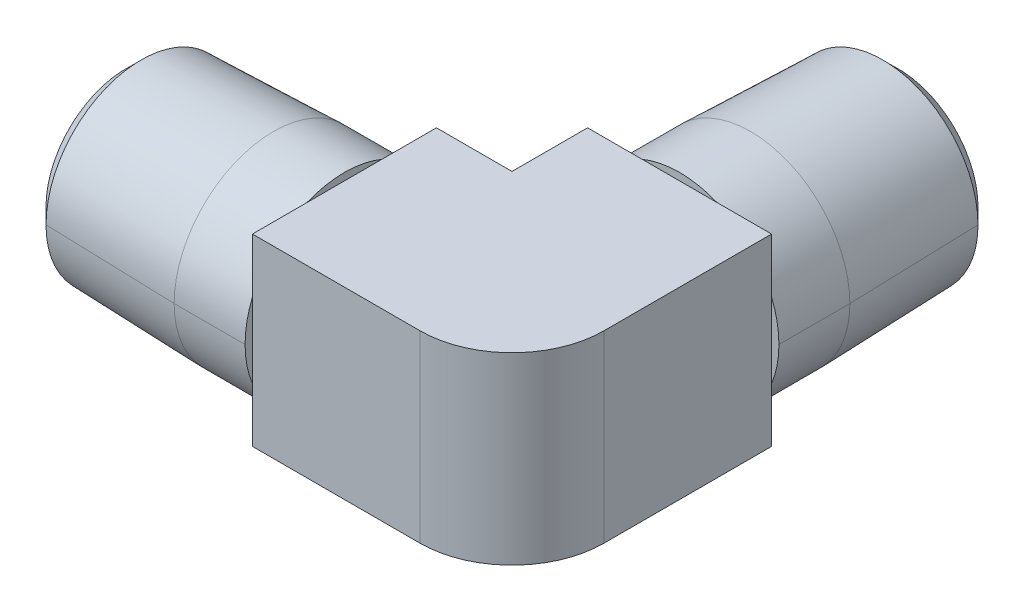
ISO-10303-21;
HEADER;
FILE_DESCRIPTION(('STEP AP214'),'2;1');
FILE_NAME('part.step','',(''),(''),'','','');
FILE_SCHEMA(('AUTOMOTIVE_DESIGN { 1 0 10303 214 1 1 1 1 }'));
ENDSEC;
DATA;
#1=APPLICATION_CONTEXT('core data for automotive mechanical design processes');
#2=APPLICATION_PROTOCOL_DEFINITION('international standard','automotive_design',2000,#1);
#3=PRODUCT_CONTEXT('',#1,'mechanical');
#4=PRODUCT('Part','Part','',(#3));
#5=PRODUCT_RELATED_PRODUCT_CATEGORY('part','',(#4));
#6=PRODUCT_DEFINITION_FORMATION('','',#4);
#7=PRODUCT_DEFINITION_CONTEXT('part definition',#1,'design');
#8=PRODUCT_DEFINITION('design','',#6,#7);
#9=PRODUCT_DEFINITION_SHAPE('','',#8);
#10=(LENGTH_UNIT() NAMED_UNIT(*) SI_UNIT(.MILLI.,.METRE.));
#11=(NAMED_UNIT(*) PLANE_ANGLE_UNIT() SI_UNIT($,.RADIAN.));
#12=(NAMED_UNIT(*) SI_UNIT($,.STERADIAN.) SOLID_ANGLE_UNIT());
#13=UNCERTAINTY_MEASURE_WITH_UNIT(LENGTH_MEASURE(1.E-05),#10,'distance_accuracy_value','');
#14=(GEOMETRIC_REPRESENTATION_CONTEXT(3) GLOBAL_UNCERTAINTY_ASSIGNED_CONTEXT((#13)) GLOBAL_UNIT_ASSIGNED_CONTEXT((#10,
#11,#12)) REPRESENTATION_CONTEXT('',''));
#15=CARTESIAN_POINT('',(0.,0.,0.));
#16=DIRECTION('',(0.,0.,1.));
#17=DIRECTION('',(1.,0.,0.));
#18=AXIS2_PLACEMENT_3D('',#15,#16,#17);
#19=CARTESIAN_POINT('',(26.67,0.,-21.56714));
#20=DIRECTION('',(0.,0.,1.));
#21=DIRECTION('',(-1.,0.,0.));
#22=AXIS2_PLACEMENT_3D('',#19,#20,#21);
#23=CONICAL_SURFACE('',#22,6.69912197832236,0.0311250383214148);
#24=DIRECTION('',(-0.0311200130745937,0.,0.999515655098127));
#25=VECTOR('',#24,1.);
#26=CARTESIAN_POINT('',(19.9708780216776,0.,-21.56714));
#27=LINE('',#26,#25);
#28=CARTESIAN_POINT('',(20.0962574044187,0.,-25.5940874044187));
#29=VERTEX_POINT('',#28);
#30=CARTESIAN_POINT('',(19.812,0.,-16.46428));
#31=VERTEX_POINT('',#30);
#32=EDGE_CURVE('E27',#29,#31,#27,.T.);
#33=ORIENTED_EDGE('',*,*,#32,.F.);
#34=CARTESIAN_POINT('',(26.67,0.,-25.5940874044187));
#35=DIRECTION('',(0.,0.,1.));
#36=DIRECTION('',(-1.,0.,0.));
#37=AXIS2_PLACEMENT_3D('',#34,#35,#36);
#38=CIRCLE('',#37,6.57374259558132);
#39=CARTESIAN_POINT('',(33.2437425955813,0.,-25.5940874044187));
#40=VERTEX_POINT('',#39);
#41=EDGE_CURVE('E323',#29,#40,#38,.T.);
#42=ORIENTED_EDGE('',*,*,#41,.T.);
#43=DIRECTION('',(-0.0311200130745934,0.,-0.999515655098127));
#44=VECTOR('',#43,1.);
#45=CARTESIAN_POINT('',(33.3691219783224,0.,-21.56714));
#46=LINE('',#45,#44);
#47=CARTESIAN_POINT('',(33.528,0.,-16.46428));
#48=VERTEX_POINT('',#47);
#49=EDGE_CURVE('E10',#48,#40,#46,.T.);
#50=ORIENTED_EDGE('',*,*,#49,.F.);
#51=CARTESIAN_POINT('',(26.67,0.,-16.46428));
#52=DIRECTION('',(0.,0.,1.));
#53=DIRECTION('',(-1.,0.,0.));
#54=AXIS2_PLACEMENT_3D('',#51,#52,#53);
#55=CIRCLE('',#54,6.858);
#56=EDGE_CURVE('E320',#31,#48,#55,.T.);
#57=ORIENTED_EDGE('',*,*,#56,.F.);
#58=EDGE_LOOP('',(#33,#42,#50,#57));
#59=FACE_BOUND('',#58,.T.);
#60=ADVANCED_FACE('F16',(#59),#23,.T.);
#61=CARTESIAN_POINT('',(26.67,0.,-21.56714));
#62=DIRECTION('',(0.,0.,1.));
#63=DIRECTION('',(-1.,0.,0.));
#64=AXIS2_PLACEMENT_3D('',#61,#62,#63);
#65=CONICAL_SURFACE('',#64,6.69912197832236,0.0311250383214148);
#66=ORIENTED_EDGE('',*,*,#32,.T.);
#67=CARTESIAN_POINT('',(26.67,0.,-16.46428));
#68=DIRECTION('',(0.,0.,1.));
#69=DIRECTION('',(-1.,0.,0.));
#70=AXIS2_PLACEMENT_3D('',#67,#68,#69);
#71=CIRCLE('',#70,6.858);
#72=EDGE_CURVE('E324',#48,#31,#71,.T.);
#73=ORIENTED_EDGE('',*,*,#72,.F.);
#74=ORIENTED_EDGE('',*,*,#49,.T.);
#75=CARTESIAN_POINT('',(26.67,0.,-25.5940874044187));
#76=DIRECTION('',(0.,0.,1.));
#77=DIRECTION('',(-1.,0.,0.));
#78=AXIS2_PLACEMENT_3D('',#75,#76,#77);
#79=CIRCLE('',#78,6.57374259558132);
#80=EDGE_CURVE('E399',#40,#29,#79,.T.);
#81=ORIENTED_EDGE('',*,*,#80,.T.);
#82=EDGE_LOOP('',(#66,#73,#74,#81));
#83=FACE_BOUND('',#82,.T.);
#84=ADVANCED_FACE('F924',(#83),#65,.T.);
#85=CARTESIAN_POINT('',(26.67,0.,-25.989915));
#86=DIRECTION('',(0.,0.,1.));
#87=DIRECTION('',(-1.,0.,0.));
#88=AXIS2_PLACEMENT_3D('',#85,#86,#87);
#89=CONICAL_SURFACE('',#88,6.177915,0.785398163397449);
#90=DIRECTION('',(0.707106781186548,0.,-0.707106781186547));
#91=VECTOR('',#90,1.);
#92=CARTESIAN_POINT('',(20.492085,0.,-25.989915));
#93=LINE('',#92,#91);
#94=CARTESIAN_POINT('',(21.17217,0.,-26.67));
#95=VERTEX_POINT('',#94);
#96=EDGE_CURVE('E410',#29,#95,#93,.T.);
#97=ORIENTED_EDGE('',*,*,#96,.T.);
#98=CARTESIAN_POINT('',(26.67,0.,-26.67));
#99=DIRECTION('',(0.,0.,-1.));
#100=DIRECTION('',(-1.,0.,0.));
#101=AXIS2_PLACEMENT_3D('',#98,#99,#100);
#102=CIRCLE('',#101,5.49783);
#103=CARTESIAN_POINT('',(32.16783,0.,-26.67));
#104=VERTEX_POINT('',#103);
#105=EDGE_CURVE('E417',#104,#95,#102,.T.);
#106=ORIENTED_EDGE('',*,*,#105,.F.);
#107=DIRECTION('',(0.707106781186548,0.,0.707106781186547));
#108=VECTOR('',#107,1.);
#109=CARTESIAN_POINT('',(32.847915,0.,-25.989915));
#110=LINE('',#109,#108);
#111=EDGE_CURVE('E396',#104,#40,#110,.T.);
#112=ORIENTED_EDGE('',*,*,#111,.T.);
#113=ORIENTED_EDGE('',*,*,#41,.F.);
#114=EDGE_LOOP('',(#97,#106,#112,#113));
#115=FACE_BOUND('',#114,.T.);
#116=ADVANCED_FACE('F920',(#115),#89,.T.);
#117=CARTESIAN_POINT('',(26.67,0.,-14.01572));
#118=DIRECTION('',(0.,0.,1.));
#119=DIRECTION('',(-1.,0.,0.));
#120=AXIS2_PLACEMENT_3D('',#117,#118,#119);
#121=CYLINDRICAL_SURFACE('',#120,6.858);
#122=DIRECTION('',(0.,0.,1.));
#123=VECTOR('',#122,1.);
#124=CARTESIAN_POINT('',(19.812,0.,-14.01572));
#125=LINE('',#124,#123);
#126=CARTESIAN_POINT('',(19.812,0.,-11.56716));
#127=VERTEX_POINT('',#126);
#128=EDGE_CURVE('E20',#31,#127,#125,.T.);
#129=ORIENTED_EDGE('',*,*,#128,.F.);
#130=ORIENTED_EDGE('',*,*,#56,.T.);
#131=DIRECTION('',(0.,0.,-1.));
#132=VECTOR('',#131,1.);
#133=CARTESIAN_POINT('',(33.528,0.,-14.01572));
#134=LINE('',#133,#132);
#135=CARTESIAN_POINT('',(33.528,0.,-11.56716));
#136=VERTEX_POINT('',#135);
#137=EDGE_CURVE('E408',#136,#48,#134,.T.);
#138=ORIENTED_EDGE('',*,*,#137,.F.);
#139=CARTESIAN_POINT('',(26.67,0.,-11.56716));
#140=DIRECTION('',(0.,0.,1.));
#141=DIRECTION('',(-1.,0.,0.));
#142=AXIS2_PLACEMENT_3D('',#139,#140,#141);
#143=CIRCLE('',#142,6.858);
#144=CARTESIAN_POINT('',(33.02,-2.59030191290514,-11.56716));
#145=VERTEX_POINT('',#144);
#146=EDGE_CURVE('E516',#145,#136,#143,.T.);
#147=ORIENTED_EDGE('',*,*,#146,.F.);
#148=CARTESIAN_POINT('',(26.67,0.,-11.56716));
#149=DIRECTION('',(0.,0.,1.));
#150=DIRECTION('',(-1.,0.,0.));
#151=AXIS2_PLACEMENT_3D('',#148,#149,#150);
#152=CIRCLE('',#151,6.858);
#153=CARTESIAN_POINT('',(29.2603019129051,-6.35,-11.56716));
#154=VERTEX_POINT('',#153);
#155=EDGE_CURVE('E430',#154,#145,#152,.T.);
#156=ORIENTED_EDGE('',*,*,#155,.F.);
#157=CARTESIAN_POINT('',(26.67,0.,-11.56716));
#158=DIRECTION('',(0.,0.,1.));
#159=DIRECTION('',(-1.,0.,0.));
#160=AXIS2_PLACEMENT_3D('',#157,#158,#159);
#161=CIRCLE('',#160,6.858);
#162=CARTESIAN_POINT('',(24.0796980870949,-6.35,-11.56716));
#163=VERTEX_POINT('',#162);
#164=EDGE_CURVE('E355',#163,#154,#161,.T.);
#165=ORIENTED_EDGE('',*,*,#164,.F.);
#166=CARTESIAN_POINT('',(26.67,0.,-11.56716));
#167=DIRECTION('',(0.,0.,1.));
#168=DIRECTION('',(-1.,0.,0.));
#169=AXIS2_PLACEMENT_3D('',#166,#167,#168);
#170=CIRCLE('',#169,6.858);
#171=CARTESIAN_POINT('',(20.32,-2.59030191290514,-11.56716));
#172=VERTEX_POINT('',#171);
#173=EDGE_CURVE('E319',#172,#163,#170,.T.);
#174=ORIENTED_EDGE('',*,*,#173,.F.);
#175=CARTESIAN_POINT('',(26.67,0.,-11.56716));
#176=DIRECTION('',(0.,0.,1.));
#177=DIRECTION('',(-1.,0.,0.));
#178=AXIS2_PLACEMENT_3D('',#175,#176,#177);
#179=CIRCLE('',#178,6.858);
#180=EDGE_CURVE('E281',#127,#172,#179,.T.);
#181=ORIENTED_EDGE('',*,*,#180,.F.);
#182=EDGE_LOOP('',(#129,#130,#138,#147,#156,#165,#174,#181));
#183=FACE_BOUND('',#182,.T.);
#184=ADVANCED_FACE('F686',(#183),#121,.T.);
#185=CARTESIAN_POINT('',(26.67,0.,-14.01572));
#186=DIRECTION('',(0.,0.,1.));
#187=DIRECTION('',(-1.,0.,0.));
#188=AXIS2_PLACEMENT_3D('',#185,#186,#187);
#189=CYLINDRICAL_SURFACE('',#188,6.858);
#190=ORIENTED_EDGE('',*,*,#128,.T.);
#191=CARTESIAN_POINT('',(26.67,0.,-11.56716));
#192=DIRECTION('',(0.,0.,1.));
#193=DIRECTION('',(-1.,0.,0.));
#194=AXIS2_PLACEMENT_3D('',#191,#192,#193);
#195=CIRCLE('',#194,6.858);
#196=CARTESIAN_POINT('',(20.32,2.59030191290514,-11.56716));
#197=VERTEX_POINT('',#196);
#198=EDGE_CURVE('E277',#197,#127,#195,.T.);
#199=ORIENTED_EDGE('',*,*,#198,.F.);
#200=CARTESIAN_POINT('',(26.67,0.,-11.56716));
#201=DIRECTION('',(0.,0.,1.));
#202=DIRECTION('',(-1.,0.,0.));
#203=AXIS2_PLACEMENT_3D('',#200,#201,#202);
#204=CIRCLE('',#203,6.858);
#205=CARTESIAN_POINT('',(24.0796980870949,6.35,-11.56716));
#206=VERTEX_POINT('',#205);
#207=EDGE_CURVE('E282',#206,#197,#204,.T.);
#208=ORIENTED_EDGE('',*,*,#207,.F.);
#209=CARTESIAN_POINT('',(26.67,0.,-11.56716));
#210=DIRECTION('',(0.,0.,1.));
#211=DIRECTION('',(-1.,0.,0.));
#212=AXIS2_PLACEMENT_3D('',#209,#210,#211);
#213=CIRCLE('',#212,6.858);
#214=CARTESIAN_POINT('',(29.2603019129051,6.35,-11.56716));
#215=VERTEX_POINT('',#214);
#216=EDGE_CURVE('E304',#215,#206,#213,.T.);
#217=ORIENTED_EDGE('',*,*,#216,.F.);
#218=CARTESIAN_POINT('',(26.67,0.,-11.56716));
#219=DIRECTION('',(0.,0.,1.));
#220=DIRECTION('',(-1.,0.,0.));
#221=AXIS2_PLACEMENT_3D('',#218,#219,#220);
#222=CIRCLE('',#221,6.858);
#223=CARTESIAN_POINT('',(33.02,2.59030191290514,-11.56716));
#224=VERTEX_POINT('',#223);
#225=EDGE_CURVE('E425',#224,#215,#222,.T.);
#226=ORIENTED_EDGE('',*,*,#225,.F.);
#227=CARTESIAN_POINT('',(26.67,0.,-11.56716));
#228=DIRECTION('',(0.,0.,1.));
#229=DIRECTION('',(-1.,0.,0.));
#230=AXIS2_PLACEMENT_3D('',#227,#228,#229);
#231=CIRCLE('',#230,6.858);
#232=EDGE_CURVE('E520',#136,#224,#231,.T.);
#233=ORIENTED_EDGE('',*,*,#232,.F.);
#234=ORIENTED_EDGE('',*,*,#137,.T.);
#235=ORIENTED_EDGE('',*,*,#72,.T.);
#236=EDGE_LOOP('',(#190,#199,#208,#217,#226,#233,#234,#235));
#237=FACE_BOUND('',#236,.T.);
#238=ADVANCED_FACE('F678',(#237),#189,.T.);
#239=CARTESIAN_POINT('',(26.67,0.,-25.989915));
#240=DIRECTION('',(0.,0.,1.));
#241=DIRECTION('',(-1.,0.,0.));
#242=AXIS2_PLACEMENT_3D('',#239,#240,#241);
#243=CONICAL_SURFACE('',#242,6.177915,0.785398163397449);
#244=ORIENTED_EDGE('',*,*,#96,.F.);
#245=ORIENTED_EDGE('',*,*,#80,.F.);
#246=ORIENTED_EDGE('',*,*,#111,.F.);
#247=CARTESIAN_POINT('',(26.67,0.,-26.67));
#248=DIRECTION('',(0.,0.,-1.));
#249=DIRECTION('',(-1.,0.,0.));
#250=AXIS2_PLACEMENT_3D('',#247,#248,#249);
#251=CIRCLE('',#250,5.49783);
#252=EDGE_CURVE('E522',#95,#104,#251,.T.);
#253=ORIENTED_EDGE('',*,*,#252,.F.);
#254=EDGE_LOOP('',(#244,#245,#246,#253));
#255=FACE_BOUND('',#254,.T.);
#256=ADVANCED_FACE('F1223',(#255),#243,.T.);
#257=CARTESIAN_POINT('',(23.3998780216776,0.,-26.67));
#258=DIRECTION('',(0.,0.,-1.));
#259=DIRECTION('',(0.,-1.,0.));
#260=AXIS2_PLACEMENT_3D('',#257,#258,#259);
#261=PLANE('',#260);
#262=ORIENTED_EDGE('',*,*,#252,.T.);
#263=ORIENTED_EDGE('',*,*,#105,.T.);
#264=EDGE_LOOP('',(#262,#263));
#265=FACE_BOUND('',#264,.T.);
#266=CARTESIAN_POINT('',(26.67,0.,-26.67));
#267=DIRECTION('',(0.,0.,1.));
#268=DIRECTION('',(-1.,0.,0.));
#269=AXIS2_PLACEMENT_3D('',#266,#267,#268);
#270=CIRCLE('',#269,3.556);
#271=CARTESIAN_POINT('',(23.114,0.,-26.67));
#272=VERTEX_POINT('',#271);
#273=CARTESIAN_POINT('',(30.226,0.,-26.67));
#274=VERTEX_POINT('',#273);
#275=EDGE_CURVE('E422',#272,#274,#270,.T.);
#276=ORIENTED_EDGE('',*,*,#275,.T.);
#277=CARTESIAN_POINT('',(26.67,0.,-26.67));
#278=DIRECTION('',(0.,0.,1.));
#279=DIRECTION('',(-1.,0.,0.));
#280=AXIS2_PLACEMENT_3D('',#277,#278,#279);
#281=CIRCLE('',#280,3.556);
#282=EDGE_CURVE('E551',#274,#272,#281,.T.);
#283=ORIENTED_EDGE('',*,*,#282,.T.);
#284=EDGE_LOOP('',(#276,#283));
#285=FACE_BOUND('',#284,.T.);
#286=ADVANCED_FACE('F1227',(#265,#285),#261,.T.);
#287=CARTESIAN_POINT('',(23.241,0.,-11.56716));
#288=DIRECTION('',(0.,0.,1.));
#289=DIRECTION('',(1.,0.,0.));
#290=AXIS2_PLACEMENT_3D('',#287,#288,#289);
#291=PLANE('',#290);
#292=DIRECTION('',(0.,-1.,0.));
#293=VECTOR('',#292,1.);
#294=CARTESIAN_POINT('',(33.02,-3.175,-11.56716));
#295=LINE('',#294,#293);
#296=EDGE_CURVE('E390',#224,#145,#295,.T.);
#297=ORIENTED_EDGE('',*,*,#296,.T.);
#298=ORIENTED_EDGE('',*,*,#146,.T.);
#299=ORIENTED_EDGE('',*,*,#232,.T.);
#300=EDGE_LOOP('',(#297,#298,#299));
#301=FACE_BOUND('',#300,.T.);
#302=ADVANCED_FACE('F1060',(#301),#291,.T.);
#303=CARTESIAN_POINT('',(29.845,0.,-11.56716));
#304=DIRECTION('',(0.,0.,-1.));
#305=DIRECTION('',(0.,-1.,0.));
#306=AXIS2_PLACEMENT_3D('',#303,#304,#305);
#307=PLANE('',#306);
#308=ORIENTED_EDGE('',*,*,#155,.T.);
#309=DIRECTION('',(0.,1.,0.));
#310=VECTOR('',#309,1.);
#311=CARTESIAN_POINT('',(33.02,-6.35,-11.56716));
#312=LINE('',#311,#310);
#313=CARTESIAN_POINT('',(33.02,-6.35,-11.56716));
#314=VERTEX_POINT('',#313);
#315=EDGE_CURVE('E386',#314,#145,#312,.T.);
#316=ORIENTED_EDGE('',*,*,#315,.F.);
#317=DIRECTION('',(1.,0.,0.));
#318=VECTOR('',#317,1.);
#319=CARTESIAN_POINT('',(20.32,-6.35,-11.56716));
#320=LINE('',#319,#318);
#321=EDGE_CURVE('E591',#154,#314,#320,.T.);
#322=ORIENTED_EDGE('',*,*,#321,.F.);
#323=EDGE_LOOP('',(#308,#316,#322));
#324=FACE_BOUND('',#323,.T.);
#325=ADVANCED_FACE('F690',(#324),#307,.T.);
#326=CARTESIAN_POINT('',(23.241,0.,-11.56716));
#327=DIRECTION('',(0.,0.,1.));
#328=DIRECTION('',(1.,0.,0.));
#329=AXIS2_PLACEMENT_3D('',#326,#327,#328);
#330=PLANE('',#329);
#331=DIRECTION('',(-1.,0.,0.));
#332=VECTOR('',#331,1.);
#333=CARTESIAN_POINT('',(19.17192,-6.35,-11.56716));
#334=LINE('',#333,#332);
#335=EDGE_CURVE('E395',#154,#163,#334,.T.);
#336=ORIENTED_EDGE('',*,*,#335,.T.);
#337=ORIENTED_EDGE('',*,*,#164,.T.);
#338=EDGE_LOOP('',(#336,#337));
#339=FACE_BOUND('',#338,.T.);
#340=ADVANCED_FACE('F688',(#339),#330,.T.);
#341=CARTESIAN_POINT('',(29.845,0.,-11.56716));
#342=DIRECTION('',(0.,0.,-1.));
#343=DIRECTION('',(0.,-1.,0.));
#344=AXIS2_PLACEMENT_3D('',#341,#342,#343);
#345=PLANE('',#344);
#346=ORIENTED_EDGE('',*,*,#173,.T.);
#347=DIRECTION('',(1.,0.,0.));
#348=VECTOR('',#347,1.);
#349=CARTESIAN_POINT('',(20.32,-6.35,-11.56716));
#350=LINE('',#349,#348);
#351=CARTESIAN_POINT('',(20.32,-6.35,-11.56716));
#352=VERTEX_POINT('',#351);
#353=EDGE_CURVE('E379',#352,#163,#350,.T.);
#354=ORIENTED_EDGE('',*,*,#353,.F.);
#355=DIRECTION('',(0.,-1.,0.));
#356=VECTOR('',#355,1.);
#357=CARTESIAN_POINT('',(20.32,6.35,-11.56716));
#358=LINE('',#357,#356);
#359=EDGE_CURVE('E325',#172,#352,#358,.T.);
#360=ORIENTED_EDGE('',*,*,#359,.F.);
#361=EDGE_LOOP('',(#346,#354,#360));
#362=FACE_BOUND('',#361,.T.);
#363=ADVANCED_FACE('F685',(#362),#345,.T.);
#364=CARTESIAN_POINT('',(23.241,0.,-11.56716));
#365=DIRECTION('',(0.,0.,1.));
#366=DIRECTION('',(1.,0.,0.));
#367=AXIS2_PLACEMENT_3D('',#364,#365,#366);
#368=PLANE('',#367);
#369=DIRECTION('',(0.,1.,0.));
#370=VECTOR('',#369,1.);
#371=CARTESIAN_POINT('',(20.32,3.175,-11.56716));
#372=LINE('',#371,#370);
#373=EDGE_CURVE('E329',#172,#197,#372,.T.);
#374=ORIENTED_EDGE('',*,*,#373,.T.);
#375=ORIENTED_EDGE('',*,*,#198,.T.);
#376=ORIENTED_EDGE('',*,*,#180,.T.);
#377=EDGE_LOOP('',(#374,#375,#376));
#378=FACE_BOUND('',#377,.T.);
#379=ADVANCED_FACE('F682',(#378),#368,.T.);
#380=CARTESIAN_POINT('',(29.845,0.,-11.56716));
#381=DIRECTION('',(0.,0.,-1.));
#382=DIRECTION('',(0.,-1.,0.));
#383=AXIS2_PLACEMENT_3D('',#380,#381,#382);
#384=PLANE('',#383);
#385=ORIENTED_EDGE('',*,*,#207,.T.);
#386=DIRECTION('',(0.,-1.,0.));
#387=VECTOR('',#386,1.);
#388=CARTESIAN_POINT('',(20.32,6.35,-11.56716));
#389=LINE('',#388,#387);
#390=CARTESIAN_POINT('',(20.32,6.35,-11.56716));
#391=VERTEX_POINT('',#390);
#392=EDGE_CURVE('E384',#391,#197,#389,.T.);
#393=ORIENTED_EDGE('',*,*,#392,.F.);
#394=DIRECTION('',(-1.,0.,0.));
#395=VECTOR('',#394,1.);
#396=CARTESIAN_POINT('',(33.02,6.35,-11.56716));
#397=LINE('',#396,#395);
#398=EDGE_CURVE('E385',#206,#391,#397,.T.);
#399=ORIENTED_EDGE('',*,*,#398,.F.);
#400=EDGE_LOOP('',(#385,#393,#399));
#401=FACE_BOUND('',#400,.T.);
#402=ADVANCED_FACE('F634',(#401),#384,.T.);
#403=CARTESIAN_POINT('',(23.241,0.,-11.56716));
#404=DIRECTION('',(0.,0.,1.));
#405=DIRECTION('',(1.,0.,0.));
#406=AXIS2_PLACEMENT_3D('',#403,#404,#405);
#407=PLANE('',#406);
#408=DIRECTION('',(1.,0.,0.));
#409=VECTOR('',#408,1.);
#410=CARTESIAN_POINT('',(19.17192,6.35,-11.56716));
#411=LINE('',#410,#409);
#412=EDGE_CURVE('E488',#206,#215,#411,.T.);
#413=ORIENTED_EDGE('',*,*,#412,.T.);
#414=ORIENTED_EDGE('',*,*,#216,.T.);
#415=EDGE_LOOP('',(#413,#414));
#416=FACE_BOUND('',#415,.T.);
#417=ADVANCED_FACE('F631',(#416),#407,.T.);
#418=CARTESIAN_POINT('',(29.845,0.,-11.56716));
#419=DIRECTION('',(0.,0.,-1.));
#420=DIRECTION('',(0.,-1.,0.));
#421=AXIS2_PLACEMENT_3D('',#418,#419,#420);
#422=PLANE('',#421);
#423=ORIENTED_EDGE('',*,*,#225,.T.);
#424=DIRECTION('',(-1.,0.,0.));
#425=VECTOR('',#424,1.);
#426=CARTESIAN_POINT('',(33.02,6.35,-11.56716));
#427=LINE('',#426,#425);
#428=CARTESIAN_POINT('',(33.02,6.35,-11.56716));
#429=VERTEX_POINT('',#428);
#430=EDGE_CURVE('E290',#429,#215,#427,.T.);
#431=ORIENTED_EDGE('',*,*,#430,.F.);
#432=DIRECTION('',(0.,1.,0.));
#433=VECTOR('',#432,1.);
#434=CARTESIAN_POINT('',(33.02,-6.35,-11.56716));
#435=LINE('',#434,#433);
#436=EDGE_CURVE('E547',#224,#429,#435,.T.);
#437=ORIENTED_EDGE('',*,*,#436,.F.);
#438=EDGE_LOOP('',(#423,#431,#437));
#439=FACE_BOUND('',#438,.T.);
#440=ADVANCED_FACE('F625',(#439),#422,.T.);
#441=CARTESIAN_POINT('',(26.67,0.,-19.11858));
#442=DIRECTION('',(0.,0.,-1.));
#443=DIRECTION('',(-1.,0.,0.));
#444=AXIS2_PLACEMENT_3D('',#441,#442,#443);
#445=CYLINDRICAL_SURFACE('',#444,3.556);
#446=DIRECTION('',(0.,0.,1.));
#447=VECTOR('',#446,1.);
#448=CARTESIAN_POINT('',(23.114,0.,-19.11858));
#449=LINE('',#448,#447);
#450=CARTESIAN_POINT('',(23.114,0.,-3.556));
#451=VERTEX_POINT('',#450);
#452=EDGE_CURVE('E548',#272,#451,#449,.T.);
#453=ORIENTED_EDGE('',*,*,#452,.T.);
#454=CARTESIAN_POINT('',(26.67,0.,0.));
#455=DIRECTION('',(0.707106781186548,0.,-0.707106781186547));
#456=DIRECTION('',(0.707106781186547,0.,0.707106781186548));
#457=AXIS2_PLACEMENT_3D('',#454,#455,#456);
#458=ELLIPSE('',#457,5.02894342779873,3.556);
#459=CARTESIAN_POINT('',(26.67,-3.556,0.));
#460=VERTEX_POINT('',#459);
#461=EDGE_CURVE('E291',#460,#451,#458,.T.);
#462=ORIENTED_EDGE('',*,*,#461,.F.);
#463=CARTESIAN_POINT('',(26.67,0.,0.));
#464=DIRECTION('',(0.,0.,1.));
#465=DIRECTION('',(1.,0.,0.));
#466=AXIS2_PLACEMENT_3D('',#463,#464,#465);
#467=CIRCLE('',#466,3.556);
#468=CARTESIAN_POINT('',(30.226,0.,0.));
#469=VERTEX_POINT('',#468);
#470=EDGE_CURVE('E351',#460,#469,#467,.T.);
#471=ORIENTED_EDGE('',*,*,#470,.T.);
#472=DIRECTION('',(0.,0.,-1.));
#473=VECTOR('',#472,1.);
#474=CARTESIAN_POINT('',(30.226,0.,-19.11858));
#475=LINE('',#474,#473);
#476=EDGE_CURVE('E426',#469,#274,#475,.T.);
#477=ORIENTED_EDGE('',*,*,#476,.T.);
#478=ORIENTED_EDGE('',*,*,#275,.F.);
#479=EDGE_LOOP('',(#453,#462,#471,#477,#478));
#480=FACE_BOUND('',#479,.T.);
#481=ADVANCED_FACE('F951',(#480),#445,.F.);
#482=CARTESIAN_POINT('',(26.67,0.,-19.11858));
#483=DIRECTION('',(0.,0.,-1.));
#484=DIRECTION('',(-1.,0.,0.));
#485=AXIS2_PLACEMENT_3D('',#482,#483,#484);
#486=CYLINDRICAL_SURFACE('',#485,3.556);
#487=ORIENTED_EDGE('',*,*,#452,.F.);
#488=ORIENTED_EDGE('',*,*,#282,.F.);
#489=ORIENTED_EDGE('',*,*,#476,.F.);
#490=CARTESIAN_POINT('',(26.67,0.,0.));
#491=DIRECTION('',(0.,0.,1.));
#492=DIRECTION('',(1.,0.,0.));
#493=AXIS2_PLACEMENT_3D('',#490,#491,#492);
#494=CIRCLE('',#493,3.556);
#495=CARTESIAN_POINT('',(26.67,3.556,0.));
#496=VERTEX_POINT('',#495);
#497=EDGE_CURVE('E374',#469,#496,#494,.T.);
#498=ORIENTED_EDGE('',*,*,#497,.T.);
#499=CARTESIAN_POINT('',(26.67,0.,0.));
#500=DIRECTION('',(0.707106781186548,0.,-0.707106781186547));
#501=DIRECTION('',(0.707106781186547,0.,0.707106781186548));
#502=AXIS2_PLACEMENT_3D('',#499,#500,#501);
#503=ELLIPSE('',#502,5.02894342779873,3.556);
#504=EDGE_CURVE('E366',#451,#496,#503,.T.);
#505=ORIENTED_EDGE('',*,*,#504,.F.);
#506=EDGE_LOOP('',(#487,#488,#489,#498,#505));
#507=FACE_BOUND('',#506,.T.);
#508=ADVANCED_FACE('F988',(#507),#486,.F.);
#509=CARTESIAN_POINT('',(33.02,-6.35,0.));
#510=DIRECTION('',(1.,0.,0.));
#511=DIRECTION('',(0.,1.,0.));
#512=AXIS2_PLACEMENT_3D('',#509,#510,#511);
#513=PLANE('',#512);
#514=ORIENTED_EDGE('',*,*,#315,.T.);
#515=ORIENTED_EDGE('',*,*,#296,.F.);
#516=ORIENTED_EDGE('',*,*,#436,.T.);
#517=DIRECTION('',(0.,0.,-1.));
#518=VECTOR('',#517,1.);
#519=CARTESIAN_POINT('',(33.02,6.35,0.));
#520=LINE('',#519,#518);
#521=CARTESIAN_POINT('',(33.02,6.35,0.));
#522=VERTEX_POINT('',#521);
#523=EDGE_CURVE('E286',#522,#429,#520,.T.);
#524=ORIENTED_EDGE('',*,*,#523,.F.);
#525=DIRECTION('',(0.,1.,0.));
#526=VECTOR('',#525,1.);
#527=CARTESIAN_POINT('',(33.02,-6.35,0.));
#528=LINE('',#527,#526);
#529=CARTESIAN_POINT('',(33.02,-6.35,0.));
#530=VERTEX_POINT('',#529);
#531=EDGE_CURVE('E308',#530,#522,#528,.T.);
#532=ORIENTED_EDGE('',*,*,#531,.F.);
#533=DIRECTION('',(0.,0.,-1.));
#534=VECTOR('',#533,1.);
#535=CARTESIAN_POINT('',(33.02,-6.35,0.));
#536=LINE('',#535,#534);
#537=EDGE_CURVE('E391',#530,#314,#536,.T.);
#538=ORIENTED_EDGE('',*,*,#537,.T.);
#539=EDGE_LOOP('',(#514,#515,#516,#524,#532,#538));
#540=FACE_BOUND('',#539,.T.);
#541=ADVANCED_FACE('F693',(#540),#513,.T.);
#542=CARTESIAN_POINT('',(15.10284,-6.35,-6.35));
#543=DIRECTION('',(0.,-1.,0.));
#544=DIRECTION('',(-1.,0.,0.));
#545=AXIS2_PLACEMENT_3D('',#542,#543,#544);
#546=PLANE('',#545);
#547=DIRECTION('',(1.,0.,0.));
#548=VECTOR('',#547,1.);
#549=CARTESIAN_POINT('',(15.10284,-6.35,6.35));
#550=LINE('',#549,#548);
#551=CARTESIAN_POINT('',(15.10284,-6.35,6.35));
#552=VERTEX_POINT('',#551);
#553=CARTESIAN_POINT('',(26.67,-6.35,6.35));
#554=VERTEX_POINT('',#553);
#555=EDGE_CURVE('E499',#552,#554,#550,.T.);
#556=ORIENTED_EDGE('',*,*,#555,.F.);
#557=DIRECTION('',(0.,0.,-1.));
#558=VECTOR('',#557,1.);
#559=CARTESIAN_POINT('',(15.10284,-6.35,6.35));
#560=LINE('',#559,#558);
#561=CARTESIAN_POINT('',(15.10284,-6.35,2.59030191290514));
#562=VERTEX_POINT('',#561);
#563=EDGE_CURVE('E236',#552,#562,#560,.T.);
#564=ORIENTED_EDGE('',*,*,#563,.T.);
#565=DIRECTION('',(0.,0.,1.));
#566=VECTOR('',#565,1.);
#567=CARTESIAN_POINT('',(15.10284,-6.35,-1.4605));
#568=LINE('',#567,#566);
#569=CARTESIAN_POINT('',(15.10284,-6.35,-2.59030191290514));
#570=VERTEX_POINT('',#569);
#571=EDGE_CURVE('E229',#570,#562,#568,.T.);
#572=ORIENTED_EDGE('',*,*,#571,.F.);
#573=DIRECTION('',(0.,0.,-1.));
#574=VECTOR('',#573,1.);
#575=CARTESIAN_POINT('',(15.10284,-6.35,6.35));
#576=LINE('',#575,#574);
#577=CARTESIAN_POINT('',(15.10284,-6.35,-6.35));
#578=VERTEX_POINT('',#577);
#579=EDGE_CURVE('E233',#570,#578,#576,.T.);
#580=ORIENTED_EDGE('',*,*,#579,.T.);
#581=DIRECTION('',(1.,0.,0.));
#582=VECTOR('',#581,1.);
#583=CARTESIAN_POINT('',(15.10284,-6.35,-6.35));
#584=LINE('',#583,#582);
#585=CARTESIAN_POINT('',(20.32,-6.35,-6.35));
#586=VERTEX_POINT('',#585);
#587=EDGE_CURVE('E458',#578,#586,#584,.T.);
#588=ORIENTED_EDGE('',*,*,#587,.T.);
#589=DIRECTION('',(0.,0.,-1.));
#590=VECTOR('',#589,1.);
#591=CARTESIAN_POINT('',(20.32,-6.35,0.));
#592=LINE('',#591,#590);
#593=EDGE_CURVE('E328',#586,#352,#592,.T.);
#594=ORIENTED_EDGE('',*,*,#593,.T.);
#595=ORIENTED_EDGE('',*,*,#353,.T.);
#596=ORIENTED_EDGE('',*,*,#335,.F.);
#597=ORIENTED_EDGE('',*,*,#321,.T.);
#598=ORIENTED_EDGE('',*,*,#537,.F.);
#599=CARTESIAN_POINT('',(26.67,-6.35,0.));
#600=DIRECTION('',(0.,-1.,0.));
#601=DIRECTION('',(1.,0.,0.));
#602=AXIS2_PLACEMENT_3D('',#599,#600,#601);
#603=CIRCLE('',#602,6.35);
#604=EDGE_CURVE('E305',#530,#554,#603,.T.);
#605=ORIENTED_EDGE('',*,*,#604,.T.);
#606=EDGE_LOOP('',(#556,#564,#572,#580,#588,#594,#595,#596,#597,#598,#605));
#607=FACE_BOUND('',#606,.T.);
#608=ADVANCED_FACE('F231',(#607),#546,.T.);
#609=CARTESIAN_POINT('',(20.32,6.35,0.));
#610=DIRECTION('',(-1.,0.,0.));
#611=DIRECTION('',(0.,0.,1.));
#612=AXIS2_PLACEMENT_3D('',#609,#610,#611);
#613=PLANE('',#612);
#614=DIRECTION('',(0.,-1.,0.));
#615=VECTOR('',#614,1.);
#616=CARTESIAN_POINT('',(20.32,6.35,-6.35));
#617=LINE('',#616,#615);
#618=CARTESIAN_POINT('',(20.32,6.35,-6.35));
#619=VERTEX_POINT('',#618);
#620=EDGE_CURVE('E454',#619,#586,#617,.T.);
#621=ORIENTED_EDGE('',*,*,#620,.F.);
#622=DIRECTION('',(0.,0.,-1.));
#623=VECTOR('',#622,1.);
#624=CARTESIAN_POINT('',(20.32,6.35,0.));
#625=LINE('',#624,#623);
#626=EDGE_CURVE('E380',#619,#391,#625,.T.);
#627=ORIENTED_EDGE('',*,*,#626,.T.);
#628=ORIENTED_EDGE('',*,*,#392,.T.);
#629=ORIENTED_EDGE('',*,*,#373,.F.);
#630=ORIENTED_EDGE('',*,*,#359,.T.);
#631=ORIENTED_EDGE('',*,*,#593,.F.);
#632=EDGE_LOOP('',(#621,#627,#628,#629,#630,#631));
#633=FACE_BOUND('',#632,.T.);
#634=ADVANCED_FACE('F641',(#633),#613,.T.);
#635=CARTESIAN_POINT('',(15.10284,6.35,6.35));
#636=DIRECTION('',(0.,1.,0.));
#637=DIRECTION('',(1.,0.,0.));
#638=AXIS2_PLACEMENT_3D('',#635,#636,#637);
#639=PLANE('',#638);
#640=ORIENTED_EDGE('',*,*,#523,.T.);
#641=ORIENTED_EDGE('',*,*,#430,.T.);
#642=ORIENTED_EDGE('',*,*,#412,.F.);
#643=ORIENTED_EDGE('',*,*,#398,.T.);
#644=ORIENTED_EDGE('',*,*,#626,.F.);
#645=DIRECTION('',(1.,0.,0.));
#646=VECTOR('',#645,1.);
#647=CARTESIAN_POINT('',(15.10284,6.35,-6.35));
#648=LINE('',#647,#646);
#649=CARTESIAN_POINT('',(15.10284,6.35,-6.35));
#650=VERTEX_POINT('',#649);
#651=EDGE_CURVE('E251',#650,#619,#648,.T.);
#652=ORIENTED_EDGE('',*,*,#651,.F.);
#653=DIRECTION('',(0.,0.,1.));
#654=VECTOR('',#653,1.);
#655=CARTESIAN_POINT('',(15.10284,6.35,-6.35));
#656=LINE('',#655,#654);
#657=CARTESIAN_POINT('',(15.10284,6.35,-2.59030191290514));
#658=VERTEX_POINT('',#657);
#659=EDGE_CURVE('E477',#650,#658,#656,.T.);
#660=ORIENTED_EDGE('',*,*,#659,.T.);
#661=DIRECTION('',(0.,0.,-1.));
#662=VECTOR('',#661,1.);
#663=CARTESIAN_POINT('',(15.10284,6.35,4.8895));
#664=LINE('',#663,#662);
#665=CARTESIAN_POINT('',(15.10284,6.35,2.59030191290514));
#666=VERTEX_POINT('',#665);
#667=EDGE_CURVE('E452',#666,#658,#664,.T.);
#668=ORIENTED_EDGE('',*,*,#667,.F.);
#669=DIRECTION('',(0.,0.,1.));
#670=VECTOR('',#669,1.);
#671=CARTESIAN_POINT('',(15.10284,6.35,-6.35));
#672=LINE('',#671,#670);
#673=CARTESIAN_POINT('',(15.10284,6.35,6.35));
#674=VERTEX_POINT('',#673);
#675=EDGE_CURVE('E448',#666,#674,#672,.T.);
#676=ORIENTED_EDGE('',*,*,#675,.T.);
#677=DIRECTION('',(1.,0.,0.));
#678=VECTOR('',#677,1.);
#679=CARTESIAN_POINT('',(15.10284,6.35,6.35));
#680=LINE('',#679,#678);
#681=CARTESIAN_POINT('',(26.67,6.35,6.35));
#682=VERTEX_POINT('',#681);
#683=EDGE_CURVE('E309',#674,#682,#680,.T.);
#684=ORIENTED_EDGE('',*,*,#683,.T.);
#685=CARTESIAN_POINT('',(26.67,6.35,0.));
#686=DIRECTION('',(0.,-1.,0.));
#687=DIRECTION('',(1.,0.,0.));
#688=AXIS2_PLACEMENT_3D('',#685,#686,#687);
#689=CIRCLE('',#688,6.35);
#690=EDGE_CURVE('E334',#522,#682,#689,.T.);
#691=ORIENTED_EDGE('',*,*,#690,.F.);
#692=EDGE_LOOP('',(#640,#641,#642,#643,#644,#652,#660,#668,#676,#684,#691));
#693=FACE_BOUND('',#692,.T.);
#694=ADVANCED_FACE('F621',(#693),#639,.T.);
#695=CARTESIAN_POINT('',(7.55142,0.,0.));
#696=DIRECTION('',(-1.,0.,0.));
#697=DIRECTION('',(0.,0.,1.));
#698=AXIS2_PLACEMENT_3D('',#695,#696,#697);
#699=CYLINDRICAL_SURFACE('',#698,3.556);
#700=DIRECTION('',(1.,0.,0.));
#701=VECTOR('',#700,1.);
#702=CARTESIAN_POINT('',(7.55142,0.,3.556));
#703=LINE('',#702,#701);
#704=CARTESIAN_POINT('',(0.,0.,3.556));
#705=VERTEX_POINT('',#704);
#706=CARTESIAN_POINT('',(26.67,0.,3.556));
#707=VERTEX_POINT('',#706);
#708=EDGE_CURVE('E338',#705,#707,#703,.T.);
#709=ORIENTED_EDGE('',*,*,#708,.T.);
#710=CARTESIAN_POINT('',(26.67,0.,0.));
#711=DIRECTION('',(1.,0.,0.));
#712=DIRECTION('',(0.,0.,-1.));
#713=AXIS2_PLACEMENT_3D('',#710,#711,#712);
#714=CIRCLE('',#713,3.556);
#715=EDGE_CURVE('E347',#707,#460,#714,.T.);
#716=ORIENTED_EDGE('',*,*,#715,.T.);
#717=ORIENTED_EDGE('',*,*,#461,.T.);
#718=DIRECTION('',(-1.,0.,0.));
#719=VECTOR('',#718,1.);
#720=CARTESIAN_POINT('',(7.55142,0.,-3.556));
#721=LINE('',#720,#719);
#722=CARTESIAN_POINT('',(0.,0.,-3.556));
#723=VERTEX_POINT('',#722);
#724=EDGE_CURVE('E478',#451,#723,#721,.T.);
#725=ORIENTED_EDGE('',*,*,#724,.T.);
#726=CARTESIAN_POINT('',(0.,0.,0.));
#727=DIRECTION('',(1.,0.,0.));
#728=DIRECTION('',(0.,0.,1.));
#729=AXIS2_PLACEMENT_3D('',#726,#727,#728);
#730=CIRCLE('',#729,3.556);
#731=EDGE_CURVE('E473',#705,#723,#730,.T.);
#732=ORIENTED_EDGE('',*,*,#731,.F.);
#733=EDGE_LOOP('',(#709,#716,#717,#725,#732));
#734=FACE_BOUND('',#733,.T.);
#735=ADVANCED_FACE('F958',(#734),#699,.F.);
#736=CARTESIAN_POINT('',(26.67,0.,0.));
#737=DIRECTION('',(0.,0.,1.));
#738=DIRECTION('',(1.,0.,0.));
#739=AXIS2_PLACEMENT_3D('',#736,#737,#738);
#740=SPHERICAL_SURFACE('',#739,3.556);
#741=CARTESIAN_POINT('',(26.67,0.,0.));
#742=DIRECTION('',(0.,1.,0.));
#743=DIRECTION('',(0.,0.,1.));
#744=AXIS2_PLACEMENT_3D('',#741,#742,#743);
#745=CIRCLE('',#744,3.556);
#746=EDGE_CURVE('E365',#707,#469,#745,.T.);
#747=ORIENTED_EDGE('',*,*,#746,.T.);
#748=ORIENTED_EDGE('',*,*,#470,.F.);
#749=ORIENTED_EDGE('',*,*,#715,.F.);
#750=EDGE_LOOP('',(#747,#748,#749));
#751=FACE_BOUND('',#750,.T.);
#752=ADVANCED_FACE('F962',(#751),#740,.F.);
#753=CARTESIAN_POINT('',(26.67,0.,0.));
#754=DIRECTION('',(0.,0.,1.));
#755=DIRECTION('',(1.,0.,0.));
#756=AXIS2_PLACEMENT_3D('',#753,#754,#755);
#757=SPHERICAL_SURFACE('',#756,3.556);
#758=ORIENTED_EDGE('',*,*,#746,.F.);
#759=CARTESIAN_POINT('',(26.67,0.,0.));
#760=DIRECTION('',(1.,0.,0.));
#761=DIRECTION('',(0.,0.,-1.));
#762=AXIS2_PLACEMENT_3D('',#759,#760,#761);
#763=CIRCLE('',#762,3.556);
#764=EDGE_CURVE('E361',#496,#707,#763,.T.);
#765=ORIENTED_EDGE('',*,*,#764,.F.);
#766=ORIENTED_EDGE('',*,*,#497,.F.);
#767=EDGE_LOOP('',(#758,#765,#766));
#768=FACE_BOUND('',#767,.T.);
#769=ADVANCED_FACE('F913',(#768),#757,.F.);
#770=CARTESIAN_POINT('',(7.55142,0.,0.));
#771=DIRECTION('',(-1.,0.,0.));
#772=DIRECTION('',(0.,0.,1.));
#773=AXIS2_PLACEMENT_3D('',#770,#771,#772);
#774=CYLINDRICAL_SURFACE('',#773,3.556);
#775=ORIENTED_EDGE('',*,*,#708,.F.);
#776=CARTESIAN_POINT('',(0.,0.,0.));
#777=DIRECTION('',(1.,0.,0.));
#778=DIRECTION('',(0.,0.,1.));
#779=AXIS2_PLACEMENT_3D('',#776,#777,#778);
#780=CIRCLE('',#779,3.556);
#781=EDGE_CURVE('E462',#723,#705,#780,.T.);
#782=ORIENTED_EDGE('',*,*,#781,.F.);
#783=ORIENTED_EDGE('',*,*,#724,.F.);
#784=ORIENTED_EDGE('',*,*,#504,.T.);
#785=ORIENTED_EDGE('',*,*,#764,.T.);
#786=EDGE_LOOP('',(#775,#782,#783,#784,#785));
#787=FACE_BOUND('',#786,.T.);
#788=ADVANCED_FACE('F18',(#787),#774,.F.);
#789=CARTESIAN_POINT('',(26.67,0.,0.));
#790=DIRECTION('',(0.,-1.,0.));
#791=DIRECTION('',(1.,0.,0.));
#792=AXIS2_PLACEMENT_3D('',#789,#790,#791);
#793=CYLINDRICAL_SURFACE('',#792,6.35);
#794=DIRECTION('',(0.,1.,0.));
#795=VECTOR('',#794,1.);
#796=CARTESIAN_POINT('',(26.67,6.35,6.35));
#797=LINE('',#796,#795);
#798=EDGE_CURVE('E274',#554,#682,#797,.T.);
#799=ORIENTED_EDGE('',*,*,#798,.F.);
#800=ORIENTED_EDGE('',*,*,#604,.F.);
#801=ORIENTED_EDGE('',*,*,#531,.T.);
#802=ORIENTED_EDGE('',*,*,#690,.T.);
#803=EDGE_LOOP('',(#799,#800,#801,#802));
#804=FACE_BOUND('',#803,.T.);
#805=ADVANCED_FACE('F698',(#804),#793,.T.);
#806=CARTESIAN_POINT('',(15.10284,-6.35,6.35));
#807=DIRECTION('',(0.,0.,1.));
#808=DIRECTION('',(1.,0.,0.));
#809=AXIS2_PLACEMENT_3D('',#806,#807,#808);
#810=PLANE('',#809);
#811=DIRECTION('',(0.,-1.,0.));
#812=VECTOR('',#811,1.);
#813=CARTESIAN_POINT('',(15.10284,6.35,6.35));
#814=LINE('',#813,#812);
#815=CARTESIAN_POINT('',(15.10284,2.59030191290514,6.35));
#816=VERTEX_POINT('',#815);
#817=EDGE_CURVE('E453',#674,#816,#814,.T.);
#818=ORIENTED_EDGE('',*,*,#817,.T.);
#819=DIRECTION('',(0.,1.,0.));
#820=VECTOR('',#819,1.);
#821=CARTESIAN_POINT('',(15.10284,-3.175,6.35));
#822=LINE('',#821,#820);
#823=CARTESIAN_POINT('',(15.10284,-2.59030191290514,6.35));
#824=VERTEX_POINT('',#823);
#825=EDGE_CURVE('E469',#824,#816,#822,.T.);
#826=ORIENTED_EDGE('',*,*,#825,.F.);
#827=DIRECTION('',(0.,-1.,0.));
#828=VECTOR('',#827,1.);
#829=CARTESIAN_POINT('',(15.10284,6.35,6.35));
#830=LINE('',#829,#828);
#831=EDGE_CURVE('E495',#824,#552,#830,.T.);
#832=ORIENTED_EDGE('',*,*,#831,.T.);
#833=ORIENTED_EDGE('',*,*,#555,.T.);
#834=ORIENTED_EDGE('',*,*,#798,.T.);
#835=ORIENTED_EDGE('',*,*,#683,.F.);
#836=EDGE_LOOP('',(#818,#826,#832,#833,#834,#835));
#837=FACE_BOUND('',#836,.T.);
#838=ADVANCED_FACE('F701',(#837),#810,.T.);
#839=CARTESIAN_POINT('',(15.10284,0.,-3.175));
#840=DIRECTION('',(-1.,0.,0.));
#841=DIRECTION('',(0.,0.,1.));
#842=AXIS2_PLACEMENT_3D('',#839,#840,#841);
#843=PLANE('',#842);
#844=CARTESIAN_POINT('',(15.10284,0.,0.));
#845=DIRECTION('',(1.,0.,0.));
#846=DIRECTION('',(0.,0.,1.));
#847=AXIS2_PLACEMENT_3D('',#844,#845,#846);
#848=CIRCLE('',#847,6.858);
#849=EDGE_CURVE('E259',#824,#562,#848,.T.);
#850=ORIENTED_EDGE('',*,*,#849,.T.);
#851=ORIENTED_EDGE('',*,*,#563,.F.);
#852=ORIENTED_EDGE('',*,*,#831,.F.);
#853=EDGE_LOOP('',(#850,#851,#852));
#854=FACE_BOUND('',#853,.T.);
#855=ADVANCED_FACE('F705',(#854),#843,.T.);
#856=CARTESIAN_POINT('',(15.10284,0.,3.429));
#857=DIRECTION('',(1.,0.,0.));
#858=DIRECTION('',(0.,0.,1.));
#859=AXIS2_PLACEMENT_3D('',#856,#857,#858);
#860=PLANE('',#859);
#861=ORIENTED_EDGE('',*,*,#571,.T.);
#862=CARTESIAN_POINT('',(15.10284,0.,0.));
#863=DIRECTION('',(1.,0.,0.));
#864=DIRECTION('',(0.,0.,1.));
#865=AXIS2_PLACEMENT_3D('',#862,#863,#864);
#866=CIRCLE('',#865,6.858);
#867=EDGE_CURVE('E254',#562,#570,#866,.T.);
#868=ORIENTED_EDGE('',*,*,#867,.T.);
#869=EDGE_LOOP('',(#861,#868));
#870=FACE_BOUND('',#869,.T.);
#871=ADVANCED_FACE('F255',(#870),#860,.T.);
#872=CARTESIAN_POINT('',(15.10284,0.,-3.175));
#873=DIRECTION('',(-1.,0.,0.));
#874=DIRECTION('',(0.,0.,1.));
#875=AXIS2_PLACEMENT_3D('',#872,#873,#874);
#876=PLANE('',#875);
#877=CARTESIAN_POINT('',(15.10284,0.,0.));
#878=DIRECTION('',(1.,0.,0.));
#879=DIRECTION('',(0.,0.,1.));
#880=AXIS2_PLACEMENT_3D('',#877,#878,#879);
#881=CIRCLE('',#880,6.858);
#882=CARTESIAN_POINT('',(15.10284,-2.59030191290514,-6.35));
#883=VERTEX_POINT('',#882);
#884=EDGE_CURVE('E246',#570,#883,#881,.T.);
#885=ORIENTED_EDGE('',*,*,#884,.T.);
#886=DIRECTION('',(0.,1.,0.));
#887=VECTOR('',#886,1.);
#888=CARTESIAN_POINT('',(15.10284,-6.35,-6.35));
#889=LINE('',#888,#887);
#890=EDGE_CURVE('E248',#578,#883,#889,.T.);
#891=ORIENTED_EDGE('',*,*,#890,.F.);
#892=ORIENTED_EDGE('',*,*,#579,.F.);
#893=EDGE_LOOP('',(#885,#891,#892));
#894=FACE_BOUND('',#893,.T.);
#895=ADVANCED_FACE('F244',(#894),#876,.T.);
#896=CARTESIAN_POINT('',(15.10284,6.35,-6.35));
#897=DIRECTION('',(0.,0.,-1.));
#898=DIRECTION('',(0.,-1.,0.));
#899=AXIS2_PLACEMENT_3D('',#896,#897,#898);
#900=PLANE('',#899);
#901=ORIENTED_EDGE('',*,*,#620,.T.);
#902=ORIENTED_EDGE('',*,*,#587,.F.);
#903=ORIENTED_EDGE('',*,*,#890,.T.);
#904=DIRECTION('',(0.,-1.,0.));
#905=VECTOR('',#904,1.);
#906=CARTESIAN_POINT('',(15.10284,3.175,-6.35));
#907=LINE('',#906,#905);
#908=CARTESIAN_POINT('',(15.10284,2.59030191290514,-6.35));
#909=VERTEX_POINT('',#908);
#910=EDGE_CURVE('E271',#909,#883,#907,.T.);
#911=ORIENTED_EDGE('',*,*,#910,.F.);
#912=DIRECTION('',(0.,1.,0.));
#913=VECTOR('',#912,1.);
#914=CARTESIAN_POINT('',(15.10284,-6.35,-6.35));
#915=LINE('',#914,#913);
#916=EDGE_CURVE('E459',#909,#650,#915,.T.);
#917=ORIENTED_EDGE('',*,*,#916,.T.);
#918=ORIENTED_EDGE('',*,*,#651,.T.);
#919=EDGE_LOOP('',(#901,#902,#903,#911,#917,#918));
#920=FACE_BOUND('',#919,.T.);
#921=ADVANCED_FACE('F638',(#920),#900,.T.);
#922=CARTESIAN_POINT('',(15.10284,0.,-3.175));
#923=DIRECTION('',(-1.,0.,0.));
#924=DIRECTION('',(0.,0.,1.));
#925=AXIS2_PLACEMENT_3D('',#922,#923,#924);
#926=PLANE('',#925);
#927=CARTESIAN_POINT('',(15.10284,0.,0.));
#928=DIRECTION('',(1.,0.,0.));
#929=DIRECTION('',(0.,0.,1.));
#930=AXIS2_PLACEMENT_3D('',#927,#928,#929);
#931=CIRCLE('',#930,6.858);
#932=EDGE_CURVE('E343',#909,#658,#931,.T.);
#933=ORIENTED_EDGE('',*,*,#932,.T.);
#934=ORIENTED_EDGE('',*,*,#659,.F.);
#935=ORIENTED_EDGE('',*,*,#916,.F.);
#936=EDGE_LOOP('',(#933,#934,#935));
#937=FACE_BOUND('',#936,.T.);
#938=ADVANCED_FACE('F653',(#937),#926,.T.);
#939=CARTESIAN_POINT('',(15.10284,0.,3.429));
#940=DIRECTION('',(1.,0.,0.));
#941=DIRECTION('',(0.,0.,1.));
#942=AXIS2_PLACEMENT_3D('',#939,#940,#941);
#943=PLANE('',#942);
#944=ORIENTED_EDGE('',*,*,#667,.T.);
#945=CARTESIAN_POINT('',(15.10284,0.,0.));
#946=DIRECTION('',(1.,0.,0.));
#947=DIRECTION('',(0.,0.,1.));
#948=AXIS2_PLACEMENT_3D('',#945,#946,#947);
#949=CIRCLE('',#948,6.858);
#950=EDGE_CURVE('E339',#658,#666,#949,.T.);
#951=ORIENTED_EDGE('',*,*,#950,.T.);
#952=EDGE_LOOP('',(#944,#951));
#953=FACE_BOUND('',#952,.T.);
#954=ADVANCED_FACE('F1206',(#953),#943,.T.);
#955=CARTESIAN_POINT('',(15.10284,0.,-3.175));
#956=DIRECTION('',(-1.,0.,0.));
#957=DIRECTION('',(0.,0.,1.));
#958=AXIS2_PLACEMENT_3D('',#955,#956,#957);
#959=PLANE('',#958);
#960=CARTESIAN_POINT('',(15.10284,0.,0.));
#961=DIRECTION('',(1.,0.,0.));
#962=DIRECTION('',(0.,0.,1.));
#963=AXIS2_PLACEMENT_3D('',#960,#961,#962);
#964=CIRCLE('',#963,6.858);
#965=EDGE_CURVE('E344',#666,#816,#964,.T.);
#966=ORIENTED_EDGE('',*,*,#965,.T.);
#967=ORIENTED_EDGE('',*,*,#817,.F.);
#968=ORIENTED_EDGE('',*,*,#675,.F.);
#969=EDGE_LOOP('',(#966,#967,#968));
#970=FACE_BOUND('',#969,.T.);
#971=ADVANCED_FACE('F1185',(#970),#959,.T.);
#972=CARTESIAN_POINT('',(0.,0.,3.27012197832236));
#973=DIRECTION('',(-1.,0.,0.));
#974=DIRECTION('',(0.,0.,1.));
#975=AXIS2_PLACEMENT_3D('',#972,#973,#974);
#976=PLANE('',#975);
#977=CARTESIAN_POINT('',(0.,0.,0.));
#978=DIRECTION('',(-1.,0.,0.));
#979=DIRECTION('',(0.,0.,1.));
#980=AXIS2_PLACEMENT_3D('',#977,#978,#979);
#981=CIRCLE('',#980,5.49783);
#982=CARTESIAN_POINT('',(0.,0.,5.49783));
#983=VERTEX_POINT('',#982);
#984=CARTESIAN_POINT('',(0.,0.,-5.49783));
#985=VERTEX_POINT('',#984);
#986=EDGE_CURVE('E315',#983,#985,#981,.T.);
#987=ORIENTED_EDGE('',*,*,#986,.T.);
#988=CARTESIAN_POINT('',(0.,0.,0.));
#989=DIRECTION('',(-1.,0.,0.));
#990=DIRECTION('',(0.,0.,1.));
#991=AXIS2_PLACEMENT_3D('',#988,#989,#990);
#992=CIRCLE('',#991,5.49783);
#993=EDGE_CURVE('E299',#985,#983,#992,.T.);
#994=ORIENTED_EDGE('',*,*,#993,.T.);
#995=EDGE_LOOP('',(#987,#994));
#996=FACE_BOUND('',#995,.T.);
#997=ORIENTED_EDGE('',*,*,#731,.T.);
#998=ORIENTED_EDGE('',*,*,#781,.T.);
#999=EDGE_LOOP('',(#997,#998));
#1000=FACE_BOUND('',#999,.T.);
#1001=ADVANCED_FACE('F1165',(#996,#1000),#976,.T.);
#1002=CARTESIAN_POINT('',(15.10284,0.,3.429));
#1003=DIRECTION('',(1.,0.,0.));
#1004=DIRECTION('',(0.,0.,1.));
#1005=AXIS2_PLACEMENT_3D('',#1002,#1003,#1004);
#1006=PLANE('',#1005);
#1007=ORIENTED_EDGE('',*,*,#825,.T.);
#1008=CARTESIAN_POINT('',(15.10284,0.,0.));
#1009=DIRECTION('',(1.,0.,0.));
#1010=DIRECTION('',(0.,0.,1.));
#1011=AXIS2_PLACEMENT_3D('',#1008,#1009,#1010);
#1012=CIRCLE('',#1011,6.858);
#1013=CARTESIAN_POINT('',(15.10284,0.,6.858));
#1014=VERTEX_POINT('',#1013);
#1015=EDGE_CURVE('E314',#816,#1014,#1012,.T.);
#1016=ORIENTED_EDGE('',*,*,#1015,.T.);
#1017=CARTESIAN_POINT('',(15.10284,0.,0.));
#1018=DIRECTION('',(1.,0.,0.));
#1019=DIRECTION('',(0.,0.,1.));
#1020=AXIS2_PLACEMENT_3D('',#1017,#1018,#1019);
#1021=CIRCLE('',#1020,6.858);
#1022=EDGE_CURVE('E285',#1014,#824,#1021,.T.);
#1023=ORIENTED_EDGE('',*,*,#1022,.T.);
#1024=EDGE_LOOP('',(#1007,#1016,#1023));
#1025=FACE_BOUND('',#1024,.T.);
#1026=ADVANCED_FACE('F1118',(#1025),#1006,.T.);
#1027=CARTESIAN_POINT('',(12.65428,0.,0.));
#1028=DIRECTION('',(1.,0.,0.));
#1029=DIRECTION('',(0.,0.,1.));
#1030=AXIS2_PLACEMENT_3D('',#1027,#1028,#1029);
#1031=CYLINDRICAL_SURFACE('',#1030,6.858);
#1032=DIRECTION('',(1.,0.,0.));
#1033=VECTOR('',#1032,1.);
#1034=CARTESIAN_POINT('',(12.65428,0.,6.858));
#1035=LINE('',#1034,#1033);
#1036=CARTESIAN_POINT('',(10.20572,0.,6.858));
#1037=VERTEX_POINT('',#1036);
#1038=EDGE_CURVE('E310',#1037,#1014,#1035,.T.);
#1039=ORIENTED_EDGE('',*,*,#1038,.F.);
#1040=CARTESIAN_POINT('',(10.20572,0.,0.));
#1041=DIRECTION('',(1.,0.,0.));
#1042=DIRECTION('',(0.,0.,1.));
#1043=AXIS2_PLACEMENT_3D('',#1040,#1041,#1042);
#1044=CIRCLE('',#1043,6.858);
#1045=CARTESIAN_POINT('',(10.20572,0.,-6.858));
#1046=VERTEX_POINT('',#1045);
#1047=EDGE_CURVE('E300',#1037,#1046,#1044,.T.);
#1048=ORIENTED_EDGE('',*,*,#1047,.T.);
#1049=DIRECTION('',(-1.,0.,0.));
#1050=VECTOR('',#1049,1.);
#1051=CARTESIAN_POINT('',(12.65428,0.,-6.858));
#1052=LINE('',#1051,#1050);
#1053=CARTESIAN_POINT('',(15.10284,0.,-6.858));
#1054=VERTEX_POINT('',#1053);
#1055=EDGE_CURVE('E294',#1054,#1046,#1052,.T.);
#1056=ORIENTED_EDGE('',*,*,#1055,.F.);
#1057=CARTESIAN_POINT('',(15.10284,0.,0.));
#1058=DIRECTION('',(1.,0.,0.));
#1059=DIRECTION('',(0.,0.,1.));
#1060=AXIS2_PLACEMENT_3D('',#1057,#1058,#1059);
#1061=CIRCLE('',#1060,6.858);
#1062=EDGE_CURVE('E263',#883,#1054,#1061,.T.);
#1063=ORIENTED_EDGE('',*,*,#1062,.F.);
#1064=ORIENTED_EDGE('',*,*,#884,.F.);
#1065=ORIENTED_EDGE('',*,*,#867,.F.);
#1066=ORIENTED_EDGE('',*,*,#849,.F.);
#1067=ORIENTED_EDGE('',*,*,#1022,.F.);
#1068=EDGE_LOOP('',(#1039,#1048,#1056,#1063,#1064,#1065,#1066,#1067));
#1069=FACE_BOUND('',#1068,.T.);
#1070=ADVANCED_FACE('F261',(#1069),#1031,.T.);
#1071=CARTESIAN_POINT('',(15.10284,0.,3.429));
#1072=DIRECTION('',(1.,0.,0.));
#1073=DIRECTION('',(0.,0.,1.));
#1074=AXIS2_PLACEMENT_3D('',#1071,#1072,#1073);
#1075=PLANE('',#1074);
#1076=ORIENTED_EDGE('',*,*,#910,.T.);
#1077=ORIENTED_EDGE('',*,*,#1062,.T.);
#1078=CARTESIAN_POINT('',(15.10284,0.,0.));
#1079=DIRECTION('',(1.,0.,0.));
#1080=DIRECTION('',(0.,0.,1.));
#1081=AXIS2_PLACEMENT_3D('',#1078,#1079,#1080);
#1082=CIRCLE('',#1081,6.858);
#1083=EDGE_CURVE('E447',#1054,#909,#1082,.T.);
#1084=ORIENTED_EDGE('',*,*,#1083,.T.);
#1085=EDGE_LOOP('',(#1076,#1077,#1084));
#1086=FACE_BOUND('',#1085,.T.);
#1087=ADVANCED_FACE('F647',(#1086),#1075,.T.);
#1088=CARTESIAN_POINT('',(12.65428,0.,0.));
#1089=DIRECTION('',(1.,0.,0.));
#1090=DIRECTION('',(0.,0.,1.));
#1091=AXIS2_PLACEMENT_3D('',#1088,#1089,#1090);
#1092=CYLINDRICAL_SURFACE('',#1091,6.858);
#1093=ORIENTED_EDGE('',*,*,#1038,.T.);
#1094=ORIENTED_EDGE('',*,*,#1015,.F.);
#1095=ORIENTED_EDGE('',*,*,#965,.F.);
#1096=ORIENTED_EDGE('',*,*,#950,.F.);
#1097=ORIENTED_EDGE('',*,*,#932,.F.);
#1098=ORIENTED_EDGE('',*,*,#1083,.F.);
#1099=ORIENTED_EDGE('',*,*,#1055,.T.);
#1100=CARTESIAN_POINT('',(10.20572,0.,0.));
#1101=DIRECTION('',(1.,0.,0.));
#1102=DIRECTION('',(0.,0.,1.));
#1103=AXIS2_PLACEMENT_3D('',#1100,#1101,#1102);
#1104=CIRCLE('',#1103,6.858);
#1105=EDGE_CURVE('E371',#1046,#1037,#1104,.T.);
#1106=ORIENTED_EDGE('',*,*,#1105,.T.);
#1107=EDGE_LOOP('',(#1093,#1094,#1095,#1096,#1097,#1098,#1099,#1106));
#1108=FACE_BOUND('',#1107,.T.);
#1109=ADVANCED_FACE('F650',(#1108),#1092,.T.);
#1110=CARTESIAN_POINT('',(0.680085,0.,0.));
#1111=DIRECTION('',(1.,0.,0.));
#1112=DIRECTION('',(0.,0.,1.));
#1113=AXIS2_PLACEMENT_3D('',#1110,#1111,#1112);
#1114=CONICAL_SURFACE('',#1113,6.177915,0.785398163397449);
#1115=DIRECTION('',(-0.707106781186547,0.,-0.707106781186548));
#1116=VECTOR('',#1115,1.);
#1117=CARTESIAN_POINT('',(0.680085,0.,6.177915));
#1118=LINE('',#1117,#1116);
#1119=CARTESIAN_POINT('',(1.07591259558132,0.,6.57374259558132));
#1120=VERTEX_POINT('',#1119);
#1121=EDGE_CURVE('E295',#1120,#983,#1118,.T.);
#1122=ORIENTED_EDGE('',*,*,#1121,.F.);
#1123=CARTESIAN_POINT('',(1.07591259558132,0.,0.));
#1124=DIRECTION('',(1.,0.,0.));
#1125=DIRECTION('',(0.,0.,1.));
#1126=AXIS2_PLACEMENT_3D('',#1123,#1124,#1125);
#1127=CIRCLE('',#1126,6.57374259558132);
#1128=CARTESIAN_POINT('',(1.07591259558132,0.,-6.57374259558132));
#1129=VERTEX_POINT('',#1128);
#1130=EDGE_CURVE('E443',#1129,#1120,#1127,.T.);
#1131=ORIENTED_EDGE('',*,*,#1130,.F.);
#1132=DIRECTION('',(0.707106781186547,0.,-0.707106781186548));
#1133=VECTOR('',#1132,1.);
#1134=CARTESIAN_POINT('',(0.680085,0.,-6.177915));
#1135=LINE('',#1134,#1133);
#1136=EDGE_CURVE('E331',#985,#1129,#1135,.T.);
#1137=ORIENTED_EDGE('',*,*,#1136,.F.);
#1138=ORIENTED_EDGE('',*,*,#986,.F.);
#1139=EDGE_LOOP('',(#1122,#1131,#1137,#1138));
#1140=FACE_BOUND('',#1139,.T.);
#1141=ADVANCED_FACE('F1031',(#1140),#1114,.T.);
#1142=CARTESIAN_POINT('',(0.680085,0.,0.));
#1143=DIRECTION('',(1.,0.,0.));
#1144=DIRECTION('',(0.,0.,1.));
#1145=AXIS2_PLACEMENT_3D('',#1142,#1143,#1144);
#1146=CONICAL_SURFACE('',#1145,6.177915,0.785398163397449);
#1147=ORIENTED_EDGE('',*,*,#1121,.T.);
#1148=ORIENTED_EDGE('',*,*,#993,.F.);
#1149=ORIENTED_EDGE('',*,*,#1136,.T.);
#1150=CARTESIAN_POINT('',(1.07591259558132,0.,0.));
#1151=DIRECTION('',(1.,0.,0.));
#1152=DIRECTION('',(0.,0.,1.));
#1153=AXIS2_PLACEMENT_3D('',#1150,#1151,#1152);
#1154=CIRCLE('',#1153,6.57374259558132);
#1155=EDGE_CURVE('E439',#1120,#1129,#1154,.T.);
#1156=ORIENTED_EDGE('',*,*,#1155,.F.);
#1157=EDGE_LOOP('',(#1147,#1148,#1149,#1156));
#1158=FACE_BOUND('',#1157,.T.);
#1159=ADVANCED_FACE('F1026',(#1158),#1146,.T.);
#1160=CARTESIAN_POINT('',(5.10286,0.,0.));
#1161=DIRECTION('',(1.,0.,0.));
#1162=DIRECTION('',(0.,0.,1.));
#1163=AXIS2_PLACEMENT_3D('',#1160,#1161,#1162);
#1164=CONICAL_SURFACE('',#1163,6.69912197832236,0.0311250383214148);
#1165=DIRECTION('',(0.999515655098127,0.,0.0311200130745937));
#1166=VECTOR('',#1165,1.);
#1167=CARTESIAN_POINT('',(5.10286,0.,6.69912197832236));
#1168=LINE('',#1167,#1166);
#1169=EDGE_CURVE('E367',#1120,#1037,#1168,.T.);
#1170=ORIENTED_EDGE('',*,*,#1169,.F.);
#1171=ORIENTED_EDGE('',*,*,#1155,.T.);
#1172=DIRECTION('',(-0.999515655098127,0.,0.0311200130745934));
#1173=VECTOR('',#1172,1.);
#1174=CARTESIAN_POINT('',(5.10286,0.,-6.69912197832236));
#1175=LINE('',#1174,#1173);
#1176=EDGE_CURVE('E484',#1046,#1129,#1175,.T.);
#1177=ORIENTED_EDGE('',*,*,#1176,.F.);
#1178=ORIENTED_EDGE('',*,*,#1047,.F.);
#1179=EDGE_LOOP('',(#1170,#1171,#1177,#1178));
#1180=FACE_BOUND('',#1179,.T.);
#1181=ADVANCED_FACE('F1030',(#1180),#1164,.T.);
#1182=CARTESIAN_POINT('',(5.10286,0.,0.));
#1183=DIRECTION('',(1.,0.,0.));
#1184=DIRECTION('',(0.,0.,1.));
#1185=AXIS2_PLACEMENT_3D('',#1182,#1183,#1184);
#1186=CONICAL_SURFACE('',#1185,6.69912197832236,0.0311250383214148);
#1187=ORIENTED_EDGE('',*,*,#1169,.T.);
#1188=ORIENTED_EDGE('',*,*,#1105,.F.);
#1189=ORIENTED_EDGE('',*,*,#1176,.T.);
#1190=ORIENTED_EDGE('',*,*,#1130,.T.);
#1191=EDGE_LOOP('',(#1187,#1188,#1189,#1190));
#1192=FACE_BOUND('',#1191,.T.);
#1193=ADVANCED_FACE('F1070',(#1192),#1186,.T.);
#1194=CLOSED_SHELL('',(#60,#84,#116,#184,#238,#256,#286,#302,#325,#340,#363,#379,#402,#417,#440,
#481,#508,#541,#608,#634,#694,#735,#752,#769,#788,#805,#838,#855,#871,#895,#921,#938,#954,#971,
#1001,#1026,#1070,#1087,#1109,#1141,#1159,#1181,#1193));
#1195=MANIFOLD_SOLID_BREP('B1',#1194);
#1196=ADVANCED_BREP_SHAPE_REPRESENTATION('',(#18,#1195),#14);
#1197=SHAPE_DEFINITION_REPRESENTATION(#9,#1196);
ENDSEC;
END-ISO-10303-21;
